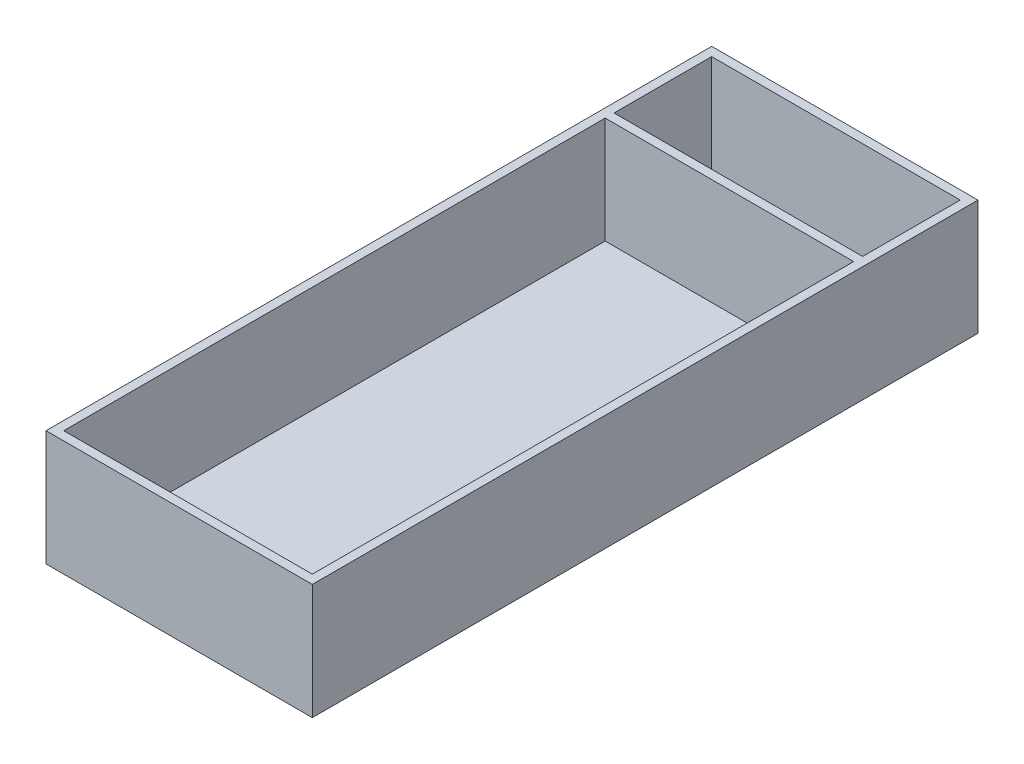
ISO-10303-21;
HEADER;
FILE_DESCRIPTION(('STEP AP214'),'2;1');
FILE_NAME('part.step','',(''),(''),'','','');
FILE_SCHEMA(('AUTOMOTIVE_DESIGN { 1 0 10303 214 1 1 1 1 }'));
ENDSEC;
DATA;
#1=APPLICATION_CONTEXT('core data for automotive mechanical design processes');
#2=APPLICATION_PROTOCOL_DEFINITION('international standard','automotive_design',2000,#1);
#3=PRODUCT_CONTEXT('',#1,'mechanical');
#4=PRODUCT('Part','Part','',(#3));
#5=PRODUCT_RELATED_PRODUCT_CATEGORY('part','',(#4));
#6=PRODUCT_DEFINITION_FORMATION('','',#4);
#7=PRODUCT_DEFINITION_CONTEXT('part definition',#1,'design');
#8=PRODUCT_DEFINITION('design','',#6,#7);
#9=PRODUCT_DEFINITION_SHAPE('','',#8);
#10=(LENGTH_UNIT() NAMED_UNIT(*) SI_UNIT(.MILLI.,.METRE.));
#11=(NAMED_UNIT(*) PLANE_ANGLE_UNIT() SI_UNIT($,.RADIAN.));
#12=(NAMED_UNIT(*) SI_UNIT($,.STERADIAN.) SOLID_ANGLE_UNIT());
#13=UNCERTAINTY_MEASURE_WITH_UNIT(LENGTH_MEASURE(1.E-05),#10,'distance_accuracy_value','');
#14=(GEOMETRIC_REPRESENTATION_CONTEXT(3) GLOBAL_UNCERTAINTY_ASSIGNED_CONTEXT((#13)) GLOBAL_UNIT_ASSIGNED_CONTEXT((#10,
#11,#12)) REPRESENTATION_CONTEXT('',''));
#15=CARTESIAN_POINT('',(0.,0.,0.));
#16=DIRECTION('',(0.,0.,1.));
#17=DIRECTION('',(1.,0.,0.));
#18=AXIS2_PLACEMENT_3D('',#15,#16,#17);
#19=CARTESIAN_POINT('',(35.56,30.48,92.71));
#20=DIRECTION('',(-1.,0.,0.));
#21=DIRECTION('',(0.,0.,1.));
#22=AXIS2_PLACEMENT_3D('',#19,#20,#21);
#23=PLANE('',#22);
#24=DIRECTION('',(0.,0.,-1.));
#25=VECTOR('',#24,1.);
#26=CARTESIAN_POINT('',(35.56,30.48,92.71));
#27=LINE('',#26,#25);
#28=CARTESIAN_POINT('',(35.56,30.48,92.71));
#29=VERTEX_POINT('',#28);
#30=CARTESIAN_POINT('',(35.56,30.48,-62.23));
#31=VERTEX_POINT('',#30);
#32=EDGE_CURVE('E170',#29,#31,#27,.T.);
#33=ORIENTED_EDGE('',*,*,#32,.T.);
#34=DIRECTION('',(0.,-1.,0.));
#35=VECTOR('',#34,1.);
#36=CARTESIAN_POINT('',(35.56,30.48,-62.23));
#37=LINE('',#36,#35);
#38=CARTESIAN_POINT('',(35.56,0.,-62.23));
#39=VERTEX_POINT('',#38);
#40=EDGE_CURVE('E151',#31,#39,#37,.T.);
#41=ORIENTED_EDGE('',*,*,#40,.T.);
#42=DIRECTION('',(0.,0.,-1.));
#43=VECTOR('',#42,1.);
#44=CARTESIAN_POINT('',(35.56,0.,92.71));
#45=LINE('',#44,#43);
#46=CARTESIAN_POINT('',(35.56,0.,92.71));
#47=VERTEX_POINT('',#46);
#48=EDGE_CURVE('E176',#47,#39,#45,.T.);
#49=ORIENTED_EDGE('',*,*,#48,.F.);
#50=DIRECTION('',(0.,-1.,0.));
#51=VECTOR('',#50,1.);
#52=CARTESIAN_POINT('',(35.56,30.48,92.71));
#53=LINE('',#52,#51);
#54=EDGE_CURVE('E175',#29,#47,#53,.T.);
#55=ORIENTED_EDGE('',*,*,#54,.F.);
#56=EDGE_LOOP('',(#33,#41,#49,#55));
#57=FACE_BOUND('',#56,.T.);
#58=ADVANCED_FACE('F57',(#57),#23,.T.);
#59=CARTESIAN_POINT('',(35.56,0.,-64.7699999999999));
#60=VERTEX_POINT('',#59);
#61=CARTESIAN_POINT('',(35.56,0.,-92.71));
#62=VERTEX_POINT('',#61);
#63=EDGE_CURVE('E180',#60,#62,#45,.T.);
#64=ORIENTED_EDGE('',*,*,#63,.F.);
#65=DIRECTION('',(0.,-1.,0.));
#66=VECTOR('',#65,1.);
#67=CARTESIAN_POINT('',(35.56,30.48,-64.77));
#68=LINE('',#67,#66);
#69=CARTESIAN_POINT('',(35.56,30.48,-64.77));
#70=VERTEX_POINT('',#69);
#71=EDGE_CURVE('E72',#70,#60,#68,.T.);
#72=ORIENTED_EDGE('',*,*,#71,.F.);
#73=CARTESIAN_POINT('',(35.56,30.48,-92.71));
#74=VERTEX_POINT('',#73);
#75=EDGE_CURVE('E189',#70,#74,#27,.T.);
#76=ORIENTED_EDGE('',*,*,#75,.T.);
#77=DIRECTION('',(0.,-1.,0.));
#78=VECTOR('',#77,1.);
#79=CARTESIAN_POINT('',(35.56,30.48,-92.71));
#80=LINE('',#79,#78);
#81=EDGE_CURVE('E195',#74,#62,#80,.T.);
#82=ORIENTED_EDGE('',*,*,#81,.T.);
#83=EDGE_LOOP('',(#64,#72,#76,#82));
#84=FACE_BOUND('',#83,.T.);
#85=ADVANCED_FACE('F240',(#84),#23,.T.);
#86=CARTESIAN_POINT('',(-35.56,30.48,92.71));
#87=DIRECTION('',(1.,0.,0.));
#88=DIRECTION('',(0.,0.,-1.));
#89=AXIS2_PLACEMENT_3D('',#86,#87,#88);
#90=PLANE('',#89);
#91=DIRECTION('',(0.,0.,1.));
#92=VECTOR('',#91,1.);
#93=CARTESIAN_POINT('',(-35.56,0.,92.71));
#94=LINE('',#93,#92);
#95=CARTESIAN_POINT('',(-35.56,0.,-62.23));
#96=VERTEX_POINT('',#95);
#97=CARTESIAN_POINT('',(-35.56,0.,92.71));
#98=VERTEX_POINT('',#97);
#99=EDGE_CURVE('E160',#96,#98,#94,.T.);
#100=ORIENTED_EDGE('',*,*,#99,.F.);
#101=DIRECTION('',(0.,-1.,0.));
#102=VECTOR('',#101,1.);
#103=CARTESIAN_POINT('',(-35.56,30.48,-62.23));
#104=LINE('',#103,#102);
#105=CARTESIAN_POINT('',(-35.56,30.48,-62.23));
#106=VERTEX_POINT('',#105);
#107=EDGE_CURVE('E148',#106,#96,#104,.T.);
#108=ORIENTED_EDGE('',*,*,#107,.F.);
#109=DIRECTION('',(0.,0.,1.));
#110=VECTOR('',#109,1.);
#111=CARTESIAN_POINT('',(-35.56,30.48,92.71));
#112=LINE('',#111,#110);
#113=CARTESIAN_POINT('',(-35.56,30.48,92.71));
#114=VERTEX_POINT('',#113);
#115=EDGE_CURVE('E80',#106,#114,#112,.T.);
#116=ORIENTED_EDGE('',*,*,#115,.T.);
#117=DIRECTION('',(0.,-1.,0.));
#118=VECTOR('',#117,1.);
#119=CARTESIAN_POINT('',(-35.56,30.48,92.71));
#120=LINE('',#119,#118);
#121=EDGE_CURVE('E191',#114,#98,#120,.T.);
#122=ORIENTED_EDGE('',*,*,#121,.T.);
#123=EDGE_LOOP('',(#100,#108,#116,#122));
#124=FACE_BOUND('',#123,.T.);
#125=ADVANCED_FACE('F159',(#124),#90,.T.);
#126=CARTESIAN_POINT('',(-35.56,30.48,-92.71));
#127=VERTEX_POINT('',#126);
#128=CARTESIAN_POINT('',(-35.56,30.48,-64.77));
#129=VERTEX_POINT('',#128);
#130=EDGE_CURVE('E166',#127,#129,#112,.T.);
#131=ORIENTED_EDGE('',*,*,#130,.T.);
#132=DIRECTION('',(0.,-1.,0.));
#133=VECTOR('',#132,1.);
#134=CARTESIAN_POINT('',(-35.56,30.48,-64.77));
#135=LINE('',#134,#133);
#136=CARTESIAN_POINT('',(-35.56,0.,-64.77));
#137=VERTEX_POINT('',#136);
#138=EDGE_CURVE('E254',#129,#137,#135,.T.);
#139=ORIENTED_EDGE('',*,*,#138,.T.);
#140=CARTESIAN_POINT('',(-35.56,0.,-92.71));
#141=VERTEX_POINT('',#140);
#142=EDGE_CURVE('E183',#141,#137,#94,.T.);
#143=ORIENTED_EDGE('',*,*,#142,.F.);
#144=DIRECTION('',(0.,-1.,0.));
#145=VECTOR('',#144,1.);
#146=CARTESIAN_POINT('',(-35.56,30.48,-92.71));
#147=LINE('',#146,#145);
#148=EDGE_CURVE('E193',#127,#141,#147,.T.);
#149=ORIENTED_EDGE('',*,*,#148,.F.);
#150=EDGE_LOOP('',(#131,#139,#143,#149));
#151=FACE_BOUND('',#150,.T.);
#152=ADVANCED_FACE('F252',(#151),#90,.T.);
#153=CARTESIAN_POINT('',(0.,0.,0.));
#154=DIRECTION('',(0.,1.,0.));
#155=DIRECTION('',(0.,0.,1.));
#156=AXIS2_PLACEMENT_3D('',#153,#154,#155);
#157=PLANE('',#156);
#158=ORIENTED_EDGE('',*,*,#48,.T.);
#159=DIRECTION('',(1.,0.,0.));
#160=VECTOR('',#159,1.);
#161=CARTESIAN_POINT('',(-35.56,0.,-62.23));
#162=LINE('',#161,#160);
#163=EDGE_CURVE('E257',#96,#39,#162,.T.);
#164=ORIENTED_EDGE('',*,*,#163,.F.);
#165=ORIENTED_EDGE('',*,*,#99,.T.);
#166=DIRECTION('',(1.,0.,0.));
#167=VECTOR('',#166,1.);
#168=CARTESIAN_POINT('',(-35.56,0.,92.71));
#169=LINE('',#168,#167);
#170=EDGE_CURVE('E186',#98,#47,#169,.T.);
#171=ORIENTED_EDGE('',*,*,#170,.T.);
#172=EDGE_LOOP('',(#158,#164,#165,#171));
#173=FACE_BOUND('',#172,.T.);
#174=ADVANCED_FACE('F277',(#173),#157,.T.);
#175=ORIENTED_EDGE('',*,*,#142,.T.);
#176=DIRECTION('',(-1.,0.,0.));
#177=VECTOR('',#176,1.);
#178=CARTESIAN_POINT('',(-35.56,0.,-64.77));
#179=LINE('',#178,#177);
#180=EDGE_CURVE('E156',#60,#137,#179,.T.);
#181=ORIENTED_EDGE('',*,*,#180,.F.);
#182=ORIENTED_EDGE('',*,*,#63,.T.);
#183=DIRECTION('',(-1.,0.,0.));
#184=VECTOR('',#183,1.);
#185=CARTESIAN_POINT('',(-35.56,0.,-92.71));
#186=LINE('',#185,#184);
#187=EDGE_CURVE('E179',#62,#141,#186,.T.);
#188=ORIENTED_EDGE('',*,*,#187,.T.);
#189=EDGE_LOOP('',(#175,#181,#182,#188));
#190=FACE_BOUND('',#189,.T.);
#191=ADVANCED_FACE('F256',(#190),#157,.T.);
#192=CARTESIAN_POINT('',(0.,30.48,0.));
#193=DIRECTION('',(0.,1.,0.));
#194=DIRECTION('',(0.,0.,1.));
#195=AXIS2_PLACEMENT_3D('',#192,#193,#194);
#196=PLANE('',#195);
#197=ORIENTED_EDGE('',*,*,#75,.F.);
#198=DIRECTION('',(-1.,0.,0.));
#199=VECTOR('',#198,1.);
#200=CARTESIAN_POINT('',(-35.56,30.48,-64.77));
#201=LINE('',#200,#199);
#202=EDGE_CURVE('E155',#70,#129,#201,.T.);
#203=ORIENTED_EDGE('',*,*,#202,.T.);
#204=ORIENTED_EDGE('',*,*,#130,.F.);
#205=DIRECTION('',(-1.,0.,0.));
#206=VECTOR('',#205,1.);
#207=CARTESIAN_POINT('',(-35.56,30.48,-92.71));
#208=LINE('',#207,#206);
#209=EDGE_CURVE('E167',#74,#127,#208,.T.);
#210=ORIENTED_EDGE('',*,*,#209,.F.);
#211=EDGE_LOOP('',(#197,#203,#204,#210));
#212=FACE_BOUND('',#211,.T.);
#213=DIRECTION('',(0.,0.,-1.));
#214=VECTOR('',#213,1.);
#215=CARTESIAN_POINT('',(38.1,30.48,0.));
#216=LINE('',#215,#214);
#217=CARTESIAN_POINT('',(38.1,30.48,95.25));
#218=VERTEX_POINT('',#217);
#219=CARTESIAN_POINT('',(38.1,30.48,-95.25));
#220=VERTEX_POINT('',#219);
#221=EDGE_CURVE('E198',#218,#220,#216,.T.);
#222=ORIENTED_EDGE('',*,*,#221,.T.);
#223=DIRECTION('',(-1.,0.,0.));
#224=VECTOR('',#223,1.);
#225=CARTESIAN_POINT('',(0.,30.48,-95.25));
#226=LINE('',#225,#224);
#227=CARTESIAN_POINT('',(-38.1,30.48,-95.25));
#228=VERTEX_POINT('',#227);
#229=EDGE_CURVE('E201',#220,#228,#226,.T.);
#230=ORIENTED_EDGE('',*,*,#229,.T.);
#231=DIRECTION('',(0.,0.,1.));
#232=VECTOR('',#231,1.);
#233=CARTESIAN_POINT('',(-38.1,30.48,0.));
#234=LINE('',#233,#232);
#235=CARTESIAN_POINT('',(-38.1,30.48,95.25));
#236=VERTEX_POINT('',#235);
#237=EDGE_CURVE('E203',#228,#236,#234,.T.);
#238=ORIENTED_EDGE('',*,*,#237,.T.);
#239=DIRECTION('',(1.,0.,0.));
#240=VECTOR('',#239,1.);
#241=CARTESIAN_POINT('',(0.,30.48,95.25));
#242=LINE('',#241,#240);
#243=EDGE_CURVE('E205',#236,#218,#242,.T.);
#244=ORIENTED_EDGE('',*,*,#243,.T.);
#245=EDGE_LOOP('',(#222,#230,#238,#244));
#246=FACE_BOUND('',#245,.T.);
#247=DIRECTION('',(1.,0.,0.));
#248=VECTOR('',#247,1.);
#249=CARTESIAN_POINT('',(-35.56,30.48,-62.23));
#250=LINE('',#249,#248);
#251=EDGE_CURVE('E146',#106,#31,#250,.T.);
#252=ORIENTED_EDGE('',*,*,#251,.T.);
#253=ORIENTED_EDGE('',*,*,#32,.F.);
#254=DIRECTION('',(1.,0.,0.));
#255=VECTOR('',#254,1.);
#256=CARTESIAN_POINT('',(-35.56,30.48,92.71));
#257=LINE('',#256,#255);
#258=EDGE_CURVE('E165',#114,#29,#257,.T.);
#259=ORIENTED_EDGE('',*,*,#258,.F.);
#260=ORIENTED_EDGE('',*,*,#115,.F.);
#261=EDGE_LOOP('',(#252,#253,#259,#260));
#262=FACE_BOUND('',#261,.T.);
#263=ADVANCED_FACE('F164',(#212,#246,#262),#196,.T.);
#264=CARTESIAN_POINT('',(38.1,30.48,0.));
#265=DIRECTION('',(-1.,0.,0.));
#266=DIRECTION('',(0.,0.,1.));
#267=AXIS2_PLACEMENT_3D('',#264,#265,#266);
#268=PLANE('',#267);
#269=DIRECTION('',(0.,-1.,0.));
#270=VECTOR('',#269,1.);
#271=CARTESIAN_POINT('',(38.1,30.48,95.25));
#272=LINE('',#271,#270);
#273=CARTESIAN_POINT('',(38.1,-2.54,95.25));
#274=VERTEX_POINT('',#273);
#275=EDGE_CURVE('E207',#218,#274,#272,.T.);
#276=ORIENTED_EDGE('',*,*,#275,.T.);
#277=DIRECTION('',(0.,0.,1.));
#278=VECTOR('',#277,1.);
#279=CARTESIAN_POINT('',(38.1,-2.54,95.25));
#280=LINE('',#279,#278);
#281=CARTESIAN_POINT('',(38.1,-2.54,-95.25));
#282=VERTEX_POINT('',#281);
#283=EDGE_CURVE('E161',#282,#274,#280,.T.);
#284=ORIENTED_EDGE('',*,*,#283,.F.);
#285=DIRECTION('',(0.,-1.,0.));
#286=VECTOR('',#285,1.);
#287=CARTESIAN_POINT('',(38.1,30.48,-95.25));
#288=LINE('',#287,#286);
#289=EDGE_CURVE('E12',#220,#282,#288,.T.);
#290=ORIENTED_EDGE('',*,*,#289,.F.);
#291=ORIENTED_EDGE('',*,*,#221,.F.);
#292=EDGE_LOOP('',(#276,#284,#290,#291));
#293=FACE_BOUND('',#292,.T.);
#294=ADVANCED_FACE('F59',(#293),#268,.F.);
#295=CARTESIAN_POINT('',(0.,30.48,-95.25));
#296=DIRECTION('',(0.,0.,1.));
#297=DIRECTION('',(1.,0.,0.));
#298=AXIS2_PLACEMENT_3D('',#295,#296,#297);
#299=PLANE('',#298);
#300=ORIENTED_EDGE('',*,*,#289,.T.);
#301=DIRECTION('',(1.,0.,0.));
#302=VECTOR('',#301,1.);
#303=CARTESIAN_POINT('',(38.1,-2.54,-95.25));
#304=LINE('',#303,#302);
#305=CARTESIAN_POINT('',(-38.1,-2.54,-95.25));
#306=VERTEX_POINT('',#305);
#307=EDGE_CURVE('E225',#306,#282,#304,.T.);
#308=ORIENTED_EDGE('',*,*,#307,.F.);
#309=DIRECTION('',(0.,-1.,0.));
#310=VECTOR('',#309,1.);
#311=CARTESIAN_POINT('',(-38.1,30.48,-95.25));
#312=LINE('',#311,#310);
#313=EDGE_CURVE('E65',#228,#306,#312,.T.);
#314=ORIENTED_EDGE('',*,*,#313,.F.);
#315=ORIENTED_EDGE('',*,*,#229,.F.);
#316=EDGE_LOOP('',(#300,#308,#314,#315));
#317=FACE_BOUND('',#316,.T.);
#318=ADVANCED_FACE('F230',(#317),#299,.F.);
#319=CARTESIAN_POINT('',(-38.1,30.48,0.));
#320=DIRECTION('',(1.,0.,0.));
#321=DIRECTION('',(0.,0.,-1.));
#322=AXIS2_PLACEMENT_3D('',#319,#320,#321);
#323=PLANE('',#322);
#324=ORIENTED_EDGE('',*,*,#313,.T.);
#325=DIRECTION('',(0.,0.,-1.));
#326=VECTOR('',#325,1.);
#327=CARTESIAN_POINT('',(-38.1,-2.54,95.25));
#328=LINE('',#327,#326);
#329=CARTESIAN_POINT('',(-38.1,-2.54,95.25));
#330=VERTEX_POINT('',#329);
#331=EDGE_CURVE('E217',#330,#306,#328,.T.);
#332=ORIENTED_EDGE('',*,*,#331,.F.);
#333=DIRECTION('',(0.,-1.,0.));
#334=VECTOR('',#333,1.);
#335=CARTESIAN_POINT('',(-38.1,30.48,95.25));
#336=LINE('',#335,#334);
#337=EDGE_CURVE('E209',#236,#330,#336,.T.);
#338=ORIENTED_EDGE('',*,*,#337,.F.);
#339=ORIENTED_EDGE('',*,*,#237,.F.);
#340=EDGE_LOOP('',(#324,#332,#338,#339));
#341=FACE_BOUND('',#340,.T.);
#342=ADVANCED_FACE('F215',(#341),#323,.F.);
#343=CARTESIAN_POINT('',(0.,30.48,95.25));
#344=DIRECTION('',(0.,0.,-1.));
#345=DIRECTION('',(-1.,0.,0.));
#346=AXIS2_PLACEMENT_3D('',#343,#344,#345);
#347=PLANE('',#346);
#348=ORIENTED_EDGE('',*,*,#337,.T.);
#349=DIRECTION('',(-1.,0.,0.));
#350=VECTOR('',#349,1.);
#351=CARTESIAN_POINT('',(38.1,-2.54,95.25));
#352=LINE('',#351,#350);
#353=EDGE_CURVE('E228',#274,#330,#352,.T.);
#354=ORIENTED_EDGE('',*,*,#353,.F.);
#355=ORIENTED_EDGE('',*,*,#275,.F.);
#356=ORIENTED_EDGE('',*,*,#243,.F.);
#357=EDGE_LOOP('',(#348,#354,#355,#356));
#358=FACE_BOUND('',#357,.T.);
#359=ADVANCED_FACE('F270',(#358),#347,.F.);
#360=CARTESIAN_POINT('',(-35.56,30.48,-92.71));
#361=DIRECTION('',(0.,0.,1.));
#362=DIRECTION('',(1.,0.,0.));
#363=AXIS2_PLACEMENT_3D('',#360,#361,#362);
#364=PLANE('',#363);
#365=ORIENTED_EDGE('',*,*,#187,.F.);
#366=ORIENTED_EDGE('',*,*,#81,.F.);
#367=ORIENTED_EDGE('',*,*,#209,.T.);
#368=ORIENTED_EDGE('',*,*,#148,.T.);
#369=EDGE_LOOP('',(#365,#366,#367,#368));
#370=FACE_BOUND('',#369,.T.);
#371=ADVANCED_FACE('F245',(#370),#364,.T.);
#372=CARTESIAN_POINT('',(-35.56,30.48,92.71));
#373=DIRECTION('',(0.,0.,-1.));
#374=DIRECTION('',(-1.,0.,0.));
#375=AXIS2_PLACEMENT_3D('',#372,#373,#374);
#376=PLANE('',#375);
#377=ORIENTED_EDGE('',*,*,#170,.F.);
#378=ORIENTED_EDGE('',*,*,#121,.F.);
#379=ORIENTED_EDGE('',*,*,#258,.T.);
#380=ORIENTED_EDGE('',*,*,#54,.T.);
#381=EDGE_LOOP('',(#377,#378,#379,#380));
#382=FACE_BOUND('',#381,.T.);
#383=ADVANCED_FACE('F288',(#382),#376,.T.);
#384=CARTESIAN_POINT('',(0.,-2.54,0.));
#385=DIRECTION('',(0.,1.,0.));
#386=DIRECTION('',(0.,0.,1.));
#387=AXIS2_PLACEMENT_3D('',#384,#385,#386);
#388=PLANE('',#387);
#389=ORIENTED_EDGE('',*,*,#283,.T.);
#390=ORIENTED_EDGE('',*,*,#353,.T.);
#391=ORIENTED_EDGE('',*,*,#331,.T.);
#392=ORIENTED_EDGE('',*,*,#307,.T.);
#393=EDGE_LOOP('',(#389,#390,#391,#392));
#394=FACE_BOUND('',#393,.T.);
#395=ADVANCED_FACE('F224',(#394),#388,.F.);
#396=CARTESIAN_POINT('',(-35.56,30.48,-62.23));
#397=DIRECTION('',(0.,0.,-1.));
#398=DIRECTION('',(-1.,0.,0.));
#399=AXIS2_PLACEMENT_3D('',#396,#397,#398);
#400=PLANE('',#399);
#401=ORIENTED_EDGE('',*,*,#163,.T.);
#402=ORIENTED_EDGE('',*,*,#40,.F.);
#403=ORIENTED_EDGE('',*,*,#251,.F.);
#404=ORIENTED_EDGE('',*,*,#107,.T.);
#405=EDGE_LOOP('',(#401,#402,#403,#404));
#406=FACE_BOUND('',#405,.T.);
#407=ADVANCED_FACE('F147',(#406),#400,.F.);
#408=CARTESIAN_POINT('',(-35.56,30.48,-64.77));
#409=DIRECTION('',(0.,0.,1.));
#410=DIRECTION('',(1.,0.,0.));
#411=AXIS2_PLACEMENT_3D('',#408,#409,#410);
#412=PLANE('',#411);
#413=ORIENTED_EDGE('',*,*,#180,.T.);
#414=ORIENTED_EDGE('',*,*,#138,.F.);
#415=ORIENTED_EDGE('',*,*,#202,.F.);
#416=ORIENTED_EDGE('',*,*,#71,.T.);
#417=EDGE_LOOP('',(#413,#414,#415,#416));
#418=FACE_BOUND('',#417,.T.);
#419=ADVANCED_FACE('F300',(#418),#412,.F.);
#420=CLOSED_SHELL('',(#58,#85,#125,#152,#174,#191,#263,#294,#318,#342,#359,#371,#383,#395,#407,#419));
#421=MANIFOLD_SOLID_BREP('B2',#420);
#422=ADVANCED_BREP_SHAPE_REPRESENTATION('',(#18,#421),#14);
#423=SHAPE_DEFINITION_REPRESENTATION(#9,#422);
ENDSEC;
END-ISO-10303-21;
